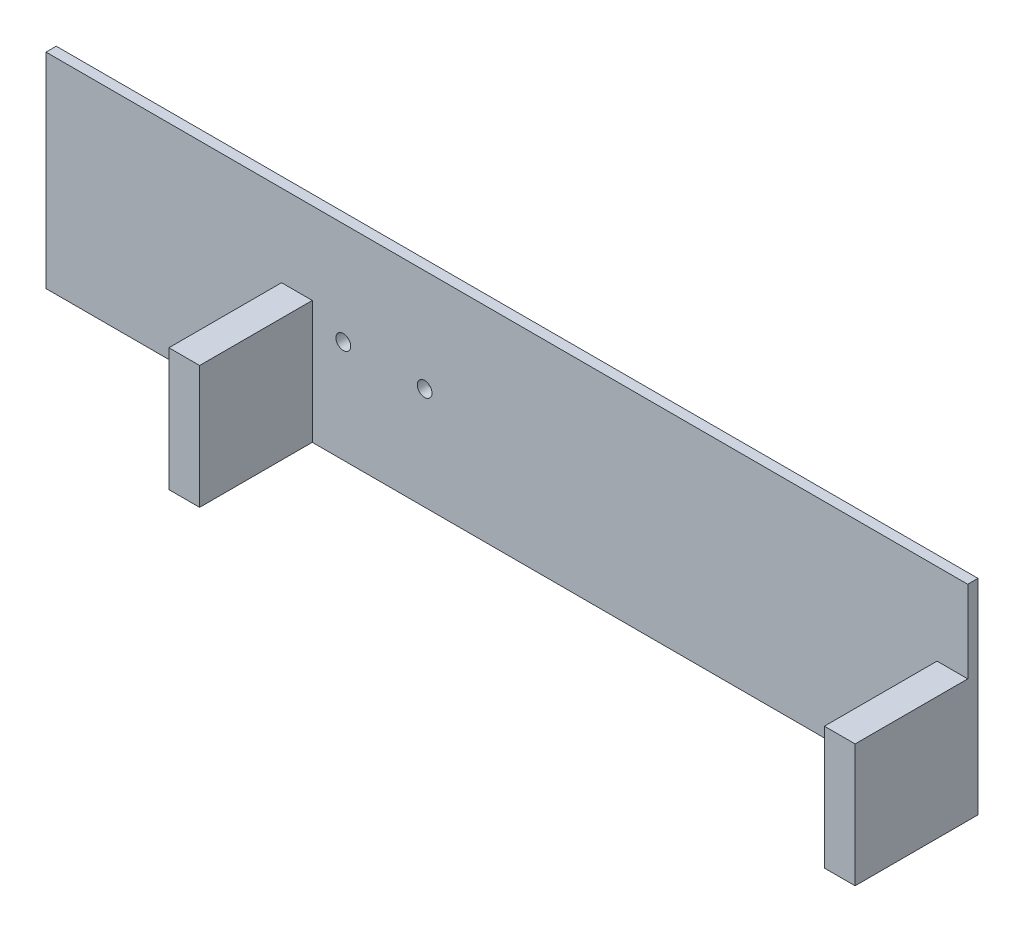
ISO-10303-21;
HEADER;
FILE_DESCRIPTION(('STEP AP214'),'2;1');
FILE_NAME('part.step','',(''),(''),'','','');
FILE_SCHEMA(('AUTOMOTIVE_DESIGN { 1 0 10303 214 1 1 1 1 }'));
ENDSEC;
DATA;
#1=APPLICATION_CONTEXT('core data for automotive mechanical design processes');
#2=APPLICATION_PROTOCOL_DEFINITION('international standard','automotive_design',2000,#1);
#3=PRODUCT_CONTEXT('',#1,'mechanical');
#4=PRODUCT('Part','Part','',(#3));
#5=PRODUCT_RELATED_PRODUCT_CATEGORY('part','',(#4));
#6=PRODUCT_DEFINITION_FORMATION('','',#4);
#7=PRODUCT_DEFINITION_CONTEXT('part definition',#1,'design');
#8=PRODUCT_DEFINITION('design','',#6,#7);
#9=PRODUCT_DEFINITION_SHAPE('','',#8);
#10=(LENGTH_UNIT() NAMED_UNIT(*) SI_UNIT(.MILLI.,.METRE.));
#11=(NAMED_UNIT(*) PLANE_ANGLE_UNIT() SI_UNIT($,.RADIAN.));
#12=(NAMED_UNIT(*) SI_UNIT($,.STERADIAN.) SOLID_ANGLE_UNIT());
#13=UNCERTAINTY_MEASURE_WITH_UNIT(LENGTH_MEASURE(1.E-05),#10,'distance_accuracy_value','');
#14=(GEOMETRIC_REPRESENTATION_CONTEXT(3) GLOBAL_UNCERTAINTY_ASSIGNED_CONTEXT((#13)) GLOBAL_UNIT_ASSIGNED_CONTEXT((#10,
#11,#12)) REPRESENTATION_CONTEXT('',''));
#15=CARTESIAN_POINT('',(0.,0.,0.));
#16=DIRECTION('',(0.,0.,1.));
#17=DIRECTION('',(1.,0.,0.));
#18=AXIS2_PLACEMENT_3D('',#15,#16,#17);
#19=CARTESIAN_POINT('',(0.,0.,5.));
#20=DIRECTION('',(0.,0.,1.));
#21=DIRECTION('',(1.,0.,0.));
#22=AXIS2_PLACEMENT_3D('',#19,#20,#21);
#23=PLANE('',#22);
#24=CARTESIAN_POINT('',(-79.85,0.,5.));
#25=DIRECTION('',(0.,0.,1.));
#26=DIRECTION('',(1.,0.,0.));
#27=AXIS2_PLACEMENT_3D('',#24,#25,#26);
#28=CIRCLE('',#27,3.6);
#29=CARTESIAN_POINT('',(-76.25,0.,5.));
#30=VERTEX_POINT('',#29);
#31=EDGE_CURVE('E261',#30,#30,#28,.T.);
#32=ORIENTED_EDGE('',*,*,#31,.F.);
#33=EDGE_LOOP('',(#32));
#34=FACE_BOUND('',#33,.T.);
#35=CARTESIAN_POINT('',(-40.15,0.,5.));
#36=DIRECTION('',(0.,0.,1.));
#37=DIRECTION('',(1.,0.,0.));
#38=AXIS2_PLACEMENT_3D('',#35,#36,#37);
#39=CIRCLE('',#38,3.6);
#40=CARTESIAN_POINT('',(-36.55,0.,5.));
#41=VERTEX_POINT('',#40);
#42=EDGE_CURVE('E275',#41,#41,#39,.T.);
#43=ORIENTED_EDGE('',*,*,#42,.F.);
#44=EDGE_LOOP('',(#43));
#45=FACE_BOUND('',#44,.T.);
#46=DIRECTION('',(1.,0.,0.));
#47=VECTOR('',#46,1.);
#48=CARTESIAN_POINT('',(225.,-50.,5.));
#49=LINE('',#48,#47);
#50=CARTESIAN_POINT('',(-225.,-50.,5.));
#51=VERTEX_POINT('',#50);
#52=CARTESIAN_POINT('',(-110.,-50.,5.));
#53=VERTEX_POINT('',#52);
#54=EDGE_CURVE('E195',#51,#53,#49,.T.);
#55=ORIENTED_EDGE('',*,*,#54,.T.);
#56=DIRECTION('',(0.,-1.,0.));
#57=VECTOR('',#56,1.);
#58=CARTESIAN_POINT('',(-110.,10.,5.));
#59=LINE('',#58,#57);
#60=CARTESIAN_POINT('',(-110.,10.,5.));
#61=VERTEX_POINT('',#60);
#62=EDGE_CURVE('E148',#61,#53,#59,.T.);
#63=ORIENTED_EDGE('',*,*,#62,.F.);
#64=DIRECTION('',(-1.,0.,0.));
#65=VECTOR('',#64,1.);
#66=CARTESIAN_POINT('',(-110.,10.,5.));
#67=LINE('',#66,#65);
#68=CARTESIAN_POINT('',(-95.0000000000001,10.,5.));
#69=VERTEX_POINT('',#68);
#70=EDGE_CURVE('E144',#69,#61,#67,.T.);
#71=ORIENTED_EDGE('',*,*,#70,.F.);
#72=DIRECTION('',(0.,1.,0.));
#73=VECTOR('',#72,1.);
#74=CARTESIAN_POINT('',(-95.0000000000001,10.,5.));
#75=LINE('',#74,#73);
#76=CARTESIAN_POINT('',(-95.0000000000001,-50.,5.));
#77=VERTEX_POINT('',#76);
#78=EDGE_CURVE('E253',#77,#69,#75,.T.);
#79=ORIENTED_EDGE('',*,*,#78,.F.);
#80=CARTESIAN_POINT('',(210.,-50.,5.));
#81=VERTEX_POINT('',#80);
#82=EDGE_CURVE('E193',#77,#81,#49,.T.);
#83=ORIENTED_EDGE('',*,*,#82,.T.);
#84=DIRECTION('',(0.,-1.,0.));
#85=VECTOR('',#84,1.);
#86=CARTESIAN_POINT('',(210.,10.,5.));
#87=LINE('',#86,#85);
#88=CARTESIAN_POINT('',(210.,10.,5.));
#89=VERTEX_POINT('',#88);
#90=EDGE_CURVE('E151',#89,#81,#87,.T.);
#91=ORIENTED_EDGE('',*,*,#90,.F.);
#92=DIRECTION('',(-1.,0.,0.));
#93=VECTOR('',#92,1.);
#94=CARTESIAN_POINT('',(210.,10.,5.));
#95=LINE('',#94,#93);
#96=CARTESIAN_POINT('',(225.,10.,5.));
#97=VERTEX_POINT('',#96);
#98=EDGE_CURVE('E63',#97,#89,#95,.T.);
#99=ORIENTED_EDGE('',*,*,#98,.F.);
#100=DIRECTION('',(0.,1.,0.));
#101=VECTOR('',#100,1.);
#102=CARTESIAN_POINT('',(225.,-50.,5.));
#103=LINE('',#102,#101);
#104=CARTESIAN_POINT('',(225.,50.,5.));
#105=VERTEX_POINT('',#104);
#106=EDGE_CURVE('E198',#97,#105,#103,.T.);
#107=ORIENTED_EDGE('',*,*,#106,.T.);
#108=DIRECTION('',(-1.,0.,0.));
#109=VECTOR('',#108,1.);
#110=CARTESIAN_POINT('',(225.,50.,5.));
#111=LINE('',#110,#109);
#112=CARTESIAN_POINT('',(-225.,50.,5.));
#113=VERTEX_POINT('',#112);
#114=EDGE_CURVE('E201',#105,#113,#111,.T.);
#115=ORIENTED_EDGE('',*,*,#114,.T.);
#116=DIRECTION('',(0.,-1.,0.));
#117=VECTOR('',#116,1.);
#118=CARTESIAN_POINT('',(-225.,-50.,5.));
#119=LINE('',#118,#117);
#120=EDGE_CURVE('E189',#113,#51,#119,.T.);
#121=ORIENTED_EDGE('',*,*,#120,.T.);
#122=EDGE_LOOP('',(#55,#63,#71,#79,#83,#91,#99,#107,#115,#121));
#123=FACE_BOUND('',#122,.T.);
#124=ADVANCED_FACE('F39',(#34,#45,#123),#23,.T.);
#125=CARTESIAN_POINT('',(-225.,-50.,5.));
#126=DIRECTION('',(1.,0.,0.));
#127=DIRECTION('',(0.,0.,-1.));
#128=AXIS2_PLACEMENT_3D('',#125,#126,#127);
#129=PLANE('',#128);
#130=DIRECTION('',(0.,-1.,0.));
#131=VECTOR('',#130,1.);
#132=CARTESIAN_POINT('',(-225.,-50.,0.));
#133=LINE('',#132,#131);
#134=CARTESIAN_POINT('',(-225.,50.,0.));
#135=VERTEX_POINT('',#134);
#136=CARTESIAN_POINT('',(-225.,-50.,0.));
#137=VERTEX_POINT('',#136);
#138=EDGE_CURVE('E188',#135,#137,#133,.T.);
#139=ORIENTED_EDGE('',*,*,#138,.T.);
#140=DIRECTION('',(0.,0.,-1.));
#141=VECTOR('',#140,1.);
#142=CARTESIAN_POINT('',(-225.,-50.,5.));
#143=LINE('',#142,#141);
#144=EDGE_CURVE('E11',#51,#137,#143,.T.);
#145=ORIENTED_EDGE('',*,*,#144,.F.);
#146=ORIENTED_EDGE('',*,*,#120,.F.);
#147=DIRECTION('',(0.,0.,-1.));
#148=VECTOR('',#147,1.);
#149=CARTESIAN_POINT('',(-225.,50.,5.));
#150=LINE('',#149,#148);
#151=EDGE_CURVE('E204',#113,#135,#150,.T.);
#152=ORIENTED_EDGE('',*,*,#151,.T.);
#153=EDGE_LOOP('',(#139,#145,#146,#152));
#154=FACE_BOUND('',#153,.T.);
#155=ADVANCED_FACE('F41',(#154),#129,.F.);
#156=CARTESIAN_POINT('',(225.,-50.,5.));
#157=DIRECTION('',(0.,1.,0.));
#158=DIRECTION('',(-1.,0.,0.));
#159=AXIS2_PLACEMENT_3D('',#156,#157,#158);
#160=PLANE('',#159);
#161=DIRECTION('',(1.,0.,0.));
#162=VECTOR('',#161,1.);
#163=CARTESIAN_POINT('',(225.,-50.,0.));
#164=LINE('',#163,#162);
#165=CARTESIAN_POINT('',(225.,-50.,0.));
#166=VERTEX_POINT('',#165);
#167=EDGE_CURVE('E208',#137,#166,#164,.T.);
#168=ORIENTED_EDGE('',*,*,#167,.T.);
#169=DIRECTION('',(0.,0.,-1.));
#170=VECTOR('',#169,1.);
#171=CARTESIAN_POINT('',(225.,-50.,5.));
#172=LINE('',#171,#170);
#173=CARTESIAN_POINT('',(225.,-50.,60.));
#174=VERTEX_POINT('',#173);
#175=EDGE_CURVE('E48',#174,#166,#172,.T.);
#176=ORIENTED_EDGE('',*,*,#175,.F.);
#177=DIRECTION('',(1.,0.,0.));
#178=VECTOR('',#177,1.);
#179=CARTESIAN_POINT('',(210.,-50.,60.));
#180=LINE('',#179,#178);
#181=CARTESIAN_POINT('',(210.,-50.,60.));
#182=VERTEX_POINT('',#181);
#183=EDGE_CURVE('E164',#182,#174,#180,.T.);
#184=ORIENTED_EDGE('',*,*,#183,.F.);
#185=DIRECTION('',(0.,0.,-1.));
#186=VECTOR('',#185,1.);
#187=CARTESIAN_POINT('',(210.,-50.,60.));
#188=LINE('',#187,#186);
#189=EDGE_CURVE('E184',#182,#81,#188,.T.);
#190=ORIENTED_EDGE('',*,*,#189,.T.);
#191=ORIENTED_EDGE('',*,*,#82,.F.);
#192=DIRECTION('',(0.,0.,-1.));
#193=VECTOR('',#192,1.);
#194=CARTESIAN_POINT('',(-95.0000000000001,-50.,60.));
#195=LINE('',#194,#193);
#196=CARTESIAN_POINT('',(-95.0000000000001,-50.,60.));
#197=VERTEX_POINT('',#196);
#198=EDGE_CURVE('E130',#197,#77,#195,.T.);
#199=ORIENTED_EDGE('',*,*,#198,.F.);
#200=DIRECTION('',(1.,0.,0.));
#201=VECTOR('',#200,1.);
#202=CARTESIAN_POINT('',(-110.,-50.,60.));
#203=LINE('',#202,#201);
#204=CARTESIAN_POINT('',(-110.,-50.,60.));
#205=VERTEX_POINT('',#204);
#206=EDGE_CURVE('E123',#205,#197,#203,.T.);
#207=ORIENTED_EDGE('',*,*,#206,.F.);
#208=DIRECTION('',(0.,0.,-1.));
#209=VECTOR('',#208,1.);
#210=CARTESIAN_POINT('',(-110.,-50.,60.));
#211=LINE('',#210,#209);
#212=EDGE_CURVE('E127',#205,#53,#211,.T.);
#213=ORIENTED_EDGE('',*,*,#212,.T.);
#214=ORIENTED_EDGE('',*,*,#54,.F.);
#215=ORIENTED_EDGE('',*,*,#144,.T.);
#216=EDGE_LOOP('',(#168,#176,#184,#190,#191,#199,#207,#213,#214,#215));
#217=FACE_BOUND('',#216,.T.);
#218=ADVANCED_FACE('F125',(#217),#160,.F.);
#219=CARTESIAN_POINT('',(225.,-50.,5.));
#220=DIRECTION('',(-1.,0.,0.));
#221=DIRECTION('',(0.,0.,1.));
#222=AXIS2_PLACEMENT_3D('',#219,#220,#221);
#223=PLANE('',#222);
#224=DIRECTION('',(0.,1.,0.));
#225=VECTOR('',#224,1.);
#226=CARTESIAN_POINT('',(225.,-50.,0.));
#227=LINE('',#226,#225);
#228=CARTESIAN_POINT('',(225.,50.,0.));
#229=VERTEX_POINT('',#228);
#230=EDGE_CURVE('E211',#166,#229,#227,.T.);
#231=ORIENTED_EDGE('',*,*,#230,.T.);
#232=DIRECTION('',(0.,0.,-1.));
#233=VECTOR('',#232,1.);
#234=CARTESIAN_POINT('',(225.,50.,5.));
#235=LINE('',#234,#233);
#236=EDGE_CURVE('E219',#105,#229,#235,.T.);
#237=ORIENTED_EDGE('',*,*,#236,.F.);
#238=ORIENTED_EDGE('',*,*,#106,.F.);
#239=DIRECTION('',(0.,0.,-1.));
#240=VECTOR('',#239,1.);
#241=CARTESIAN_POINT('',(225.,10.,60.));
#242=LINE('',#241,#240);
#243=CARTESIAN_POINT('',(225.,10.,60.));
#244=VERTEX_POINT('',#243);
#245=EDGE_CURVE('E180',#244,#97,#242,.T.);
#246=ORIENTED_EDGE('',*,*,#245,.F.);
#247=DIRECTION('',(0.,1.,0.));
#248=VECTOR('',#247,1.);
#249=CARTESIAN_POINT('',(225.,10.,60.));
#250=LINE('',#249,#248);
#251=EDGE_CURVE('E168',#174,#244,#250,.T.);
#252=ORIENTED_EDGE('',*,*,#251,.F.);
#253=ORIENTED_EDGE('',*,*,#175,.T.);
#254=EDGE_LOOP('',(#231,#237,#238,#246,#252,#253));
#255=FACE_BOUND('',#254,.T.);
#256=ADVANCED_FACE('F227',(#255),#223,.F.);
#257=CARTESIAN_POINT('',(225.,50.,5.));
#258=DIRECTION('',(0.,-1.,0.));
#259=DIRECTION('',(1.,0.,0.));
#260=AXIS2_PLACEMENT_3D('',#257,#258,#259);
#261=PLANE('',#260);
#262=DIRECTION('',(-1.,0.,0.));
#263=VECTOR('',#262,1.);
#264=CARTESIAN_POINT('',(225.,50.,0.));
#265=LINE('',#264,#263);
#266=EDGE_CURVE('E194',#229,#135,#265,.T.);
#267=ORIENTED_EDGE('',*,*,#266,.T.);
#268=ORIENTED_EDGE('',*,*,#151,.F.);
#269=ORIENTED_EDGE('',*,*,#114,.F.);
#270=ORIENTED_EDGE('',*,*,#236,.T.);
#271=EDGE_LOOP('',(#267,#268,#269,#270));
#272=FACE_BOUND('',#271,.T.);
#273=ADVANCED_FACE('F236',(#272),#261,.F.);
#274=CARTESIAN_POINT('',(0.,0.,0.));
#275=DIRECTION('',(0.,0.,1.));
#276=DIRECTION('',(1.,0.,0.));
#277=AXIS2_PLACEMENT_3D('',#274,#275,#276);
#278=PLANE('',#277);
#279=CARTESIAN_POINT('',(-79.85,0.,0.));
#280=DIRECTION('',(0.,0.,1.));
#281=DIRECTION('',(1.,0.,0.));
#282=AXIS2_PLACEMENT_3D('',#279,#280,#281);
#283=CIRCLE('',#282,3.6);
#284=CARTESIAN_POINT('',(-76.25,0.,0.));
#285=VERTEX_POINT('',#284);
#286=EDGE_CURVE('E279',#285,#285,#283,.T.);
#287=ORIENTED_EDGE('',*,*,#286,.T.);
#288=EDGE_LOOP('',(#287));
#289=FACE_BOUND('',#288,.T.);
#290=CARTESIAN_POINT('',(-40.15,0.,0.));
#291=DIRECTION('',(0.,0.,1.));
#292=DIRECTION('',(1.,0.,0.));
#293=AXIS2_PLACEMENT_3D('',#290,#291,#292);
#294=CIRCLE('',#293,3.6);
#295=CARTESIAN_POINT('',(-36.55,0.,0.));
#296=VERTEX_POINT('',#295);
#297=EDGE_CURVE('E280',#296,#296,#294,.T.);
#298=ORIENTED_EDGE('',*,*,#297,.T.);
#299=EDGE_LOOP('',(#298));
#300=FACE_BOUND('',#299,.T.);
#301=ORIENTED_EDGE('',*,*,#138,.F.);
#302=ORIENTED_EDGE('',*,*,#266,.F.);
#303=ORIENTED_EDGE('',*,*,#230,.F.);
#304=ORIENTED_EDGE('',*,*,#167,.F.);
#305=EDGE_LOOP('',(#301,#302,#303,#304));
#306=FACE_BOUND('',#305,.T.);
#307=ADVANCED_FACE('F233',(#289,#300,#306),#278,.F.);
#308=CARTESIAN_POINT('',(210.,10.,60.));
#309=DIRECTION('',(1.,0.,0.));
#310=DIRECTION('',(0.,0.,-1.));
#311=AXIS2_PLACEMENT_3D('',#308,#309,#310);
#312=PLANE('',#311);
#313=ORIENTED_EDGE('',*,*,#90,.T.);
#314=ORIENTED_EDGE('',*,*,#189,.F.);
#315=DIRECTION('',(0.,-1.,0.));
#316=VECTOR('',#315,1.);
#317=CARTESIAN_POINT('',(210.,10.,60.));
#318=LINE('',#317,#316);
#319=CARTESIAN_POINT('',(210.,10.,60.));
#320=VERTEX_POINT('',#319);
#321=EDGE_CURVE('E160',#320,#182,#318,.T.);
#322=ORIENTED_EDGE('',*,*,#321,.F.);
#323=DIRECTION('',(0.,0.,-1.));
#324=VECTOR('',#323,1.);
#325=CARTESIAN_POINT('',(210.,10.,60.));
#326=LINE('',#325,#324);
#327=EDGE_CURVE('E173',#320,#89,#326,.T.);
#328=ORIENTED_EDGE('',*,*,#327,.T.);
#329=EDGE_LOOP('',(#313,#314,#322,#328));
#330=FACE_BOUND('',#329,.T.);
#331=ADVANCED_FACE('F250',(#330),#312,.F.);
#332=CARTESIAN_POINT('',(210.,10.,60.));
#333=DIRECTION('',(0.,-1.,0.));
#334=DIRECTION('',(0.,0.,-1.));
#335=AXIS2_PLACEMENT_3D('',#332,#333,#334);
#336=PLANE('',#335);
#337=ORIENTED_EDGE('',*,*,#98,.T.);
#338=ORIENTED_EDGE('',*,*,#327,.F.);
#339=DIRECTION('',(-1.,0.,0.));
#340=VECTOR('',#339,1.);
#341=CARTESIAN_POINT('',(210.,10.,60.));
#342=LINE('',#341,#340);
#343=EDGE_CURVE('E171',#244,#320,#342,.T.);
#344=ORIENTED_EDGE('',*,*,#343,.F.);
#345=ORIENTED_EDGE('',*,*,#245,.T.);
#346=EDGE_LOOP('',(#337,#338,#344,#345));
#347=FACE_BOUND('',#346,.T.);
#348=ADVANCED_FACE('F243',(#347),#336,.F.);
#349=CARTESIAN_POINT('',(0.,0.,60.));
#350=DIRECTION('',(0.,0.,1.));
#351=DIRECTION('',(1.,0.,0.));
#352=AXIS2_PLACEMENT_3D('',#349,#350,#351);
#353=PLANE('',#352);
#354=ORIENTED_EDGE('',*,*,#321,.T.);
#355=ORIENTED_EDGE('',*,*,#183,.T.);
#356=ORIENTED_EDGE('',*,*,#251,.T.);
#357=ORIENTED_EDGE('',*,*,#343,.T.);
#358=EDGE_LOOP('',(#354,#355,#356,#357));
#359=FACE_BOUND('',#358,.T.);
#360=ADVANCED_FACE('F247',(#359),#353,.T.);
#361=CARTESIAN_POINT('',(-110.,10.,60.));
#362=DIRECTION('',(1.,0.,0.));
#363=DIRECTION('',(0.,0.,-1.));
#364=AXIS2_PLACEMENT_3D('',#361,#362,#363);
#365=PLANE('',#364);
#366=ORIENTED_EDGE('',*,*,#62,.T.);
#367=ORIENTED_EDGE('',*,*,#212,.F.);
#368=DIRECTION('',(0.,-1.,0.));
#369=VECTOR('',#368,1.);
#370=CARTESIAN_POINT('',(-110.,10.,60.));
#371=LINE('',#370,#369);
#372=CARTESIAN_POINT('',(-110.,10.,60.));
#373=VERTEX_POINT('',#372);
#374=EDGE_CURVE('E135',#373,#205,#371,.T.);
#375=ORIENTED_EDGE('',*,*,#374,.F.);
#376=DIRECTION('',(0.,0.,-1.));
#377=VECTOR('',#376,1.);
#378=CARTESIAN_POINT('',(-110.,10.,60.));
#379=LINE('',#378,#377);
#380=EDGE_CURVE('E265',#373,#61,#379,.T.);
#381=ORIENTED_EDGE('',*,*,#380,.T.);
#382=EDGE_LOOP('',(#366,#367,#375,#381));
#383=FACE_BOUND('',#382,.T.);
#384=ADVANCED_FACE('F146',(#383),#365,.F.);
#385=CARTESIAN_POINT('',(-95.0000000000001,10.,60.));
#386=DIRECTION('',(-1.,0.,0.));
#387=DIRECTION('',(0.,0.,1.));
#388=AXIS2_PLACEMENT_3D('',#385,#386,#387);
#389=PLANE('',#388);
#390=ORIENTED_EDGE('',*,*,#78,.T.);
#391=DIRECTION('',(0.,0.,-1.));
#392=VECTOR('',#391,1.);
#393=CARTESIAN_POINT('',(-95.0000000000001,10.,60.));
#394=LINE('',#393,#392);
#395=CARTESIAN_POINT('',(-95.0000000000001,10.,60.));
#396=VERTEX_POINT('',#395);
#397=EDGE_CURVE('E55',#396,#69,#394,.T.);
#398=ORIENTED_EDGE('',*,*,#397,.F.);
#399=DIRECTION('',(0.,1.,0.));
#400=VECTOR('',#399,1.);
#401=CARTESIAN_POINT('',(-95.0000000000001,10.,60.));
#402=LINE('',#401,#400);
#403=EDGE_CURVE('E134',#197,#396,#402,.T.);
#404=ORIENTED_EDGE('',*,*,#403,.F.);
#405=ORIENTED_EDGE('',*,*,#198,.T.);
#406=EDGE_LOOP('',(#390,#398,#404,#405));
#407=FACE_BOUND('',#406,.T.);
#408=ADVANCED_FACE('F356',(#407),#389,.F.);
#409=CARTESIAN_POINT('',(-110.,10.,60.));
#410=DIRECTION('',(0.,-1.,0.));
#411=DIRECTION('',(0.,0.,-1.));
#412=AXIS2_PLACEMENT_3D('',#409,#410,#411);
#413=PLANE('',#412);
#414=ORIENTED_EDGE('',*,*,#70,.T.);
#415=ORIENTED_EDGE('',*,*,#380,.F.);
#416=DIRECTION('',(-1.,0.,0.));
#417=VECTOR('',#416,1.);
#418=CARTESIAN_POINT('',(-110.,10.,60.));
#419=LINE('',#418,#417);
#420=EDGE_CURVE('E139',#396,#373,#419,.T.);
#421=ORIENTED_EDGE('',*,*,#420,.F.);
#422=ORIENTED_EDGE('',*,*,#397,.T.);
#423=EDGE_LOOP('',(#414,#415,#421,#422));
#424=FACE_BOUND('',#423,.T.);
#425=ADVANCED_FACE('F363',(#424),#413,.F.);
#426=CARTESIAN_POINT('',(0.,0.,60.));
#427=DIRECTION('',(0.,0.,1.));
#428=DIRECTION('',(1.,0.,0.));
#429=AXIS2_PLACEMENT_3D('',#426,#427,#428);
#430=PLANE('',#429);
#431=ORIENTED_EDGE('',*,*,#374,.T.);
#432=ORIENTED_EDGE('',*,*,#206,.T.);
#433=ORIENTED_EDGE('',*,*,#403,.T.);
#434=ORIENTED_EDGE('',*,*,#420,.T.);
#435=EDGE_LOOP('',(#431,#432,#433,#434));
#436=FACE_BOUND('',#435,.T.);
#437=ADVANCED_FACE('F138',(#436),#430,.T.);
#438=CARTESIAN_POINT('',(-40.15,0.,0.));
#439=DIRECTION('',(0.,0.,1.));
#440=DIRECTION('',(1.,0.,0.));
#441=AXIS2_PLACEMENT_3D('',#438,#439,#440);
#442=CYLINDRICAL_SURFACE('',#441,3.6);
#443=ORIENTED_EDGE('',*,*,#42,.T.);
#444=EDGE_LOOP('',(#443));
#445=FACE_BOUND('',#444,.T.);
#446=ORIENTED_EDGE('',*,*,#297,.F.);
#447=EDGE_LOOP('',(#446));
#448=FACE_BOUND('',#447,.T.);
#449=ADVANCED_FACE('F292',(#445,#448),#442,.F.);
#450=CARTESIAN_POINT('',(-79.85,0.,0.));
#451=DIRECTION('',(0.,0.,1.));
#452=DIRECTION('',(1.,0.,0.));
#453=AXIS2_PLACEMENT_3D('',#450,#451,#452);
#454=CYLINDRICAL_SURFACE('',#453,3.6);
#455=ORIENTED_EDGE('',*,*,#31,.T.);
#456=EDGE_LOOP('',(#455));
#457=FACE_BOUND('',#456,.T.);
#458=ORIENTED_EDGE('',*,*,#286,.F.);
#459=EDGE_LOOP('',(#458));
#460=FACE_BOUND('',#459,.T.);
#461=ADVANCED_FACE('F290',(#457,#460),#454,.F.);
#462=CLOSED_SHELL('',(#124,#155,#218,#256,#273,#307,#331,#348,#360,#384,#408,#425,#437,#449,#461));
#463=MANIFOLD_SOLID_BREP('B2',#462);
#464=ADVANCED_BREP_SHAPE_REPRESENTATION('',(#18,#463),#14);
#465=SHAPE_DEFINITION_REPRESENTATION(#9,#464);
ENDSEC;
END-ISO-10303-21;
